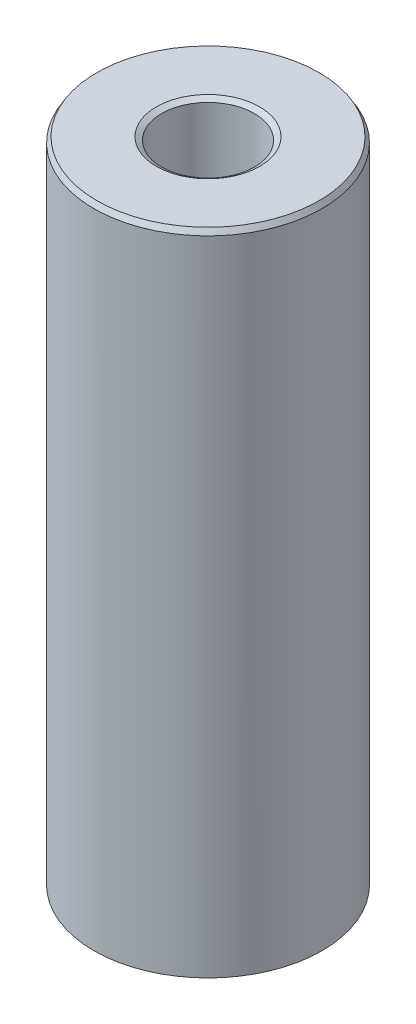
ISO-10303-21;
HEADER;
FILE_DESCRIPTION(('STEP AP214'),'2;1');
FILE_NAME('part.step','',(''),(''),'','','');
FILE_SCHEMA(('AUTOMOTIVE_DESIGN { 1 0 10303 214 1 1 1 1 }'));
ENDSEC;
DATA;
#1=APPLICATION_CONTEXT('core data for automotive mechanical design processes');
#2=APPLICATION_PROTOCOL_DEFINITION('international standard','automotive_design',2000,#1);
#3=PRODUCT_CONTEXT('',#1,'mechanical');
#4=PRODUCT('Part','Part','',(#3));
#5=PRODUCT_RELATED_PRODUCT_CATEGORY('part','',(#4));
#6=PRODUCT_DEFINITION_FORMATION('','',#4);
#7=PRODUCT_DEFINITION_CONTEXT('part definition',#1,'design');
#8=PRODUCT_DEFINITION('design','',#6,#7);
#9=PRODUCT_DEFINITION_SHAPE('','',#8);
#10=(LENGTH_UNIT() NAMED_UNIT(*) SI_UNIT(.MILLI.,.METRE.));
#11=(NAMED_UNIT(*) PLANE_ANGLE_UNIT() SI_UNIT($,.RADIAN.));
#12=(NAMED_UNIT(*) SI_UNIT($,.STERADIAN.) SOLID_ANGLE_UNIT());
#13=UNCERTAINTY_MEASURE_WITH_UNIT(LENGTH_MEASURE(1.E-05),#10,'distance_accuracy_value','');
#14=(GEOMETRIC_REPRESENTATION_CONTEXT(3) GLOBAL_UNCERTAINTY_ASSIGNED_CONTEXT((#13)) GLOBAL_UNIT_ASSIGNED_CONTEXT((#10,
#11,#12)) REPRESENTATION_CONTEXT('',''));
#15=CARTESIAN_POINT('',(0.,0.,0.));
#16=DIRECTION('',(0.,0.,1.));
#17=DIRECTION('',(1.,0.,0.));
#18=AXIS2_PLACEMENT_3D('',#15,#16,#17);
#19=CARTESIAN_POINT('',(0.,299.376387131295,0.));
#20=DIRECTION('',(0.,-1.,0.));
#21=DIRECTION('',(0.,0.,-1.));
#22=AXIS2_PLACEMENT_3D('',#19,#20,#21);
#23=CYLINDRICAL_SURFACE('',#22,52.5);
#24=CARTESIAN_POINT('',(0.,1.44388979616034,0.));
#25=DIRECTION('',(0.,1.,0.));
#26=DIRECTION('',(0.,0.,1.));
#27=AXIS2_PLACEMENT_3D('',#24,#25,#26);
#28=CIRCLE('',#27,52.5);
#29=CARTESIAN_POINT('',(0.,1.44388979616034,52.5));
#30=VERTEX_POINT('',#29);
#31=EDGE_CURVE('E10',#30,#30,#28,.T.);
#32=ORIENTED_EDGE('',*,*,#31,.T.);
#33=EDGE_LOOP('',(#32));
#34=FACE_BOUND('',#33,.T.);
#35=CARTESIAN_POINT('',(0.,296.964633989069,0.));
#36=DIRECTION('',(0.,1.,0.));
#37=DIRECTION('',(0.,0.,1.));
#38=AXIS2_PLACEMENT_3D('',#35,#36,#37);
#39=CIRCLE('',#38,52.5);
#40=CARTESIAN_POINT('',(0.,296.964633989069,-52.5));
#41=VERTEX_POINT('',#40);
#42=EDGE_CURVE('E50',#41,#41,#39,.F.);
#43=ORIENTED_EDGE('',*,*,#42,.T.);
#44=EDGE_LOOP('',(#43));
#45=FACE_BOUND('',#44,.T.);
#46=ADVANCED_FACE('F39',(#34,#45),#23,.T.);
#47=CARTESIAN_POINT('',(0.,299.376387131295,0.));
#48=DIRECTION('',(0.,1.,0.));
#49=DIRECTION('',(0.,0.,1.));
#50=AXIS2_PLACEMENT_3D('',#47,#48,#49);
#51=PLANE('',#50);
#52=CARTESIAN_POINT('',(0.,299.376387131295,0.));
#53=DIRECTION('',(0.,1.,0.));
#54=DIRECTION('',(0.,0.,1.));
#55=AXIS2_PLACEMENT_3D('',#52,#53,#54);
#56=CIRCLE('',#55,23.7471016343658);
#57=CARTESIAN_POINT('',(0.,299.376387131295,23.7471016343658));
#58=VERTEX_POINT('',#57);
#59=EDGE_CURVE('E58',#58,#58,#56,.F.);
#60=ORIENTED_EDGE('',*,*,#59,.T.);
#61=EDGE_LOOP('',(#60));
#62=FACE_BOUND('',#61,.T.);
#63=CARTESIAN_POINT('',(0.,299.376387131295,0.));
#64=DIRECTION('',(0.,1.,0.));
#65=DIRECTION('',(0.,0.,1.));
#66=AXIS2_PLACEMENT_3D('',#63,#64,#65);
#67=CIRCLE('',#66,51.0561102038397);
#68=CARTESIAN_POINT('',(0.,299.376387131295,-51.0561102038397));
#69=VERTEX_POINT('',#68);
#70=EDGE_CURVE('E61',#69,#69,#67,.T.);
#71=ORIENTED_EDGE('',*,*,#70,.T.);
#72=EDGE_LOOP('',(#71));
#73=FACE_BOUND('',#72,.T.);
#74=ADVANCED_FACE('F88',(#62,#73),#51,.T.);
#75=CARTESIAN_POINT('',(0.,0.,0.));
#76=DIRECTION('',(0.,1.,0.));
#77=DIRECTION('',(0.,0.,1.));
#78=AXIS2_PLACEMENT_3D('',#75,#76,#77);
#79=PLANE('',#78);
#80=CARTESIAN_POINT('',(0.,0.,0.));
#81=DIRECTION('',(0.,1.,0.));
#82=DIRECTION('',(0.,0.,1.));
#83=AXIS2_PLACEMENT_3D('',#80,#81,#82);
#84=CIRCLE('',#83,22.7792382882998);
#85=CARTESIAN_POINT('',(0.,0.,22.7792382882998));
#86=VERTEX_POINT('',#85);
#87=EDGE_CURVE('E51',#86,#86,#84,.T.);
#88=ORIENTED_EDGE('',*,*,#87,.T.);
#89=EDGE_LOOP('',(#88));
#90=FACE_BOUND('',#89,.T.);
#91=CARTESIAN_POINT('',(0.,0.,0.));
#92=DIRECTION('',(0.,1.,0.));
#93=DIRECTION('',(0.,0.,1.));
#94=AXIS2_PLACEMENT_3D('',#91,#92,#93);
#95=CIRCLE('',#94,50.0882468577736);
#96=CARTESIAN_POINT('',(0.,0.,50.0882468577736));
#97=VERTEX_POINT('',#96);
#98=EDGE_CURVE('E54',#97,#97,#95,.F.);
#99=ORIENTED_EDGE('',*,*,#98,.T.);
#100=EDGE_LOOP('',(#99));
#101=FACE_BOUND('',#100,.T.);
#102=ADVANCED_FACE('F83',(#90,#101),#79,.F.);
#103=CARTESIAN_POINT('',(0.,299.376387131295,0.));
#104=DIRECTION('',(0.,-1.,0.));
#105=DIRECTION('',(0.,0.,-1.));
#106=AXIS2_PLACEMENT_3D('',#103,#104,#105);
#107=CYLINDRICAL_SURFACE('',#106,21.3353484921394);
#108=CARTESIAN_POINT('',(0.,297.932497335135,0.));
#109=DIRECTION('',(0.,1.,0.));
#110=DIRECTION('',(0.,0.,1.));
#111=AXIS2_PLACEMENT_3D('',#108,#109,#110);
#112=CIRCLE('',#111,21.3353484921394);
#113=CARTESIAN_POINT('',(0.,297.932497335135,21.3353484921394));
#114=VERTEX_POINT('',#113);
#115=EDGE_CURVE('E67',#114,#114,#112,.T.);
#116=ORIENTED_EDGE('',*,*,#115,.T.);
#117=EDGE_LOOP('',(#116));
#118=FACE_BOUND('',#117,.T.);
#119=CARTESIAN_POINT('',(0.,2.41175314222636,0.));
#120=DIRECTION('',(0.,1.,0.));
#121=DIRECTION('',(0.,0.,1.));
#122=AXIS2_PLACEMENT_3D('',#119,#120,#121);
#123=CIRCLE('',#122,21.3353484921394);
#124=CARTESIAN_POINT('',(0.,2.41175314222636,21.3353484921394));
#125=VERTEX_POINT('',#124);
#126=EDGE_CURVE('E69',#125,#125,#123,.F.);
#127=ORIENTED_EDGE('',*,*,#126,.T.);
#128=EDGE_LOOP('',(#127));
#129=FACE_BOUND('',#128,.T.);
#130=ADVANCED_FACE('F71',(#118,#129),#107,.F.);
#131=CARTESIAN_POINT('',(0.,297.932497335135,0.));
#132=DIRECTION('',(0.,1.,0.));
#133=DIRECTION('',(0.,0.,1.));
#134=AXIS2_PLACEMENT_3D('',#131,#132,#133);
#135=CONICAL_SURFACE('',#134,21.3353484921394,1.03134144039072);
#136=ORIENTED_EDGE('',*,*,#59,.F.);
#137=EDGE_LOOP('',(#136));
#138=FACE_BOUND('',#137,.T.);
#139=ORIENTED_EDGE('',*,*,#115,.F.);
#140=EDGE_LOOP('',(#139));
#141=FACE_BOUND('',#140,.T.);
#142=ADVANCED_FACE('F77',(#138,#141),#135,.F.);
#143=CARTESIAN_POINT('',(0.,0.,0.));
#144=DIRECTION('',(0.,-1.,0.));
#145=DIRECTION('',(0.,0.,-1.));
#146=AXIS2_PLACEMENT_3D('',#143,#144,#145);
#147=CONICAL_SURFACE('',#146,22.7792382882998,0.539454886404164);
#148=ORIENTED_EDGE('',*,*,#126,.F.);
#149=EDGE_LOOP('',(#148));
#150=FACE_BOUND('',#149,.T.);
#151=ORIENTED_EDGE('',*,*,#87,.F.);
#152=EDGE_LOOP('',(#151));
#153=FACE_BOUND('',#152,.T.);
#154=ADVANCED_FACE('F73',(#150,#153),#147,.F.);
#155=CARTESIAN_POINT('',(0.,1.44388979616034,0.));
#156=DIRECTION('',(0.,1.,0.));
#157=DIRECTION('',(0.,0.,1.));
#158=AXIS2_PLACEMENT_3D('',#155,#156,#157);
#159=CONICAL_SURFACE('',#158,52.5,1.03134144039073);
#160=ORIENTED_EDGE('',*,*,#98,.F.);
#161=EDGE_LOOP('',(#160));
#162=FACE_BOUND('',#161,.T.);
#163=ORIENTED_EDGE('',*,*,#31,.F.);
#164=EDGE_LOOP('',(#163));
#165=FACE_BOUND('',#164,.T.);
#166=ADVANCED_FACE('F76',(#162,#165),#159,.T.);
#167=CARTESIAN_POINT('',(0.,299.376387131295,0.));
#168=DIRECTION('',(0.,-1.,0.));
#169=DIRECTION('',(0.,0.,-1.));
#170=AXIS2_PLACEMENT_3D('',#167,#168,#169);
#171=CONICAL_SURFACE('',#170,51.0561102038397,0.539454886404153);
#172=CARTESIAN_POINT('',(0.,296.964633989069,-52.5));
#173=CARTESIAN_POINT('',(0.,296.989756417634,-52.48495948129));
#174=CARTESIAN_POINT('',(0.,297.014878846199,-52.46991896258));
#175=CARTESIAN_POINT('',(0.,297.065123703328,-52.43983792516));
#176=CARTESIAN_POINT('',(0.,297.090246131893,-52.42479740645));
#177=CARTESIAN_POINT('',(0.,297.140490989023,-52.39471636903));
#178=CARTESIAN_POINT('',(0.,297.165613417588,-52.37967585032));
#179=CARTESIAN_POINT('',(0.,297.215858274717,-52.3495948129));
#180=CARTESIAN_POINT('',(0.,297.240980703282,-52.33455429419));
#181=CARTESIAN_POINT('',(0.,297.291225560412,-52.30447325677));
#182=CARTESIAN_POINT('',(0.,297.316347988977,-52.28943273806));
#183=CARTESIAN_POINT('',(0.,297.366592846107,-52.25935170064));
#184=CARTESIAN_POINT('',(0.,297.391715274672,-52.24431118193));
#185=CARTESIAN_POINT('',(0.,297.441960131801,-52.2142301445099));
#186=CARTESIAN_POINT('',(0.,297.467082560366,-52.1991896257999));
#187=CARTESIAN_POINT('',(0.,297.517327417496,-52.1691085883799));
#188=CARTESIAN_POINT('',(0.,297.542449846061,-52.1540680696699));
#189=CARTESIAN_POINT('',(0.,297.59269470319,-52.1239870322499));
#190=CARTESIAN_POINT('',(0.,297.617817131755,-52.1089465135399));
#191=CARTESIAN_POINT('',(0.,297.668061988885,-52.0788654761199));
#192=CARTESIAN_POINT('',(0.,297.69318441745,-52.0638249574099));
#193=CARTESIAN_POINT('',(0.,297.74342927458,-52.0337439199899));
#194=CARTESIAN_POINT('',(0.,297.768551703144,-52.0187034012799));
#195=CARTESIAN_POINT('',(0.,297.818796560274,-51.9886223638599));
#196=CARTESIAN_POINT('',(0.,297.843918988839,-51.9735818451499));
#197=CARTESIAN_POINT('',(0.,297.894163845969,-51.9435008077299));
#198=CARTESIAN_POINT('',(0.,297.919286274534,-51.9284602890199));
#199=CARTESIAN_POINT('',(0.,297.969531131663,-51.8983792515999));
#200=CARTESIAN_POINT('',(0.,297.994653560228,-51.8833387328899));
#201=CARTESIAN_POINT('',(0.,298.044898417358,-51.8532576954699));
#202=CARTESIAN_POINT('',(0.,298.070020845923,-51.8382171767599));
#203=CARTESIAN_POINT('',(0.,298.120265703052,-51.8081361393399));
#204=CARTESIAN_POINT('',(0.,298.145388131617,-51.7930956206298));
#205=CARTESIAN_POINT('',(0.,298.195632988747,-51.7630145832098));
#206=CARTESIAN_POINT('',(0.,298.220755417312,-51.7479740644998));
#207=CARTESIAN_POINT('',(0.,298.271000274442,-51.7178930270798));
#208=CARTESIAN_POINT('',(0.,298.296122703006,-51.7028525083698));
#209=CARTESIAN_POINT('',(0.,298.346367560136,-51.6727714709498));
#210=CARTESIAN_POINT('',(0.,298.371489988701,-51.6577309522398));
#211=CARTESIAN_POINT('',(0.,298.421734845831,-51.6276499148198));
#212=CARTESIAN_POINT('',(0.,298.446857274396,-51.6126093961098));
#213=CARTESIAN_POINT('',(0.,298.497102131525,-51.5825283586898));
#214=CARTESIAN_POINT('',(0.,298.52222456009,-51.5674878399798));
#215=CARTESIAN_POINT('',(0.,298.57246941722,-51.5374068025598));
#216=CARTESIAN_POINT('',(0.,298.597591845785,-51.5223662838498));
#217=CARTESIAN_POINT('',(0.,298.647836702914,-51.4922852464298));
#218=CARTESIAN_POINT('',(0.,298.672959131479,-51.4772447277198));
#219=CARTESIAN_POINT('',(0.,298.723203988609,-51.4471636902998));
#220=CARTESIAN_POINT('',(0.,298.748326417174,-51.4321231715898));
#221=CARTESIAN_POINT('',(0.,298.798571274304,-51.4020421341698));
#222=CARTESIAN_POINT('',(0.,298.823693702868,-51.3870016154598));
#223=CARTESIAN_POINT('',(0.,298.873938559998,-51.3569205780397));
#224=CARTESIAN_POINT('',(0.,298.899060988563,-51.3418800593297));
#225=CARTESIAN_POINT('',(0.,298.949305845693,-51.3117990219097));
#226=CARTESIAN_POINT('',(0.,298.974428274258,-51.2967585031997));
#227=CARTESIAN_POINT('',(0.,299.024673131387,-51.2666774657797));
#228=CARTESIAN_POINT('',(0.,299.049795559952,-51.2516369470697));
#229=CARTESIAN_POINT('',(0.,299.100040417082,-51.2215559096497));
#230=CARTESIAN_POINT('',(0.,299.125162845647,-51.2065153909397));
#231=CARTESIAN_POINT('',(0.,299.175407702776,-51.1764343535197));
#232=CARTESIAN_POINT('',(0.,299.200530131341,-51.1613938348097));
#233=CARTESIAN_POINT('',(0.,299.250774988471,-51.1313127973897));
#234=CARTESIAN_POINT('',(0.,299.275897417036,-51.1162722786797));
#235=CARTESIAN_POINT('',(0.,299.326142274166,-51.0861912412597));
#236=CARTESIAN_POINT('',(0.,299.35126470273,-51.0711507225497));
#237=CARTESIAN_POINT('',(0.,299.376387131295,-51.0561102038397));
#238=B_SPLINE_CURVE_WITH_KNOTS('',3,(#172,#173,#174,#175,#176,#177,#178,#179,#180,#181,#182,
#183,#184,#185,#186,#187,#188,#189,#190,#191,#192,#193,#194,#195,#196,#197,#198,#199,#200,#201,
#202,#203,#204,#205,#206,#207,#208,#209,#210,#211,#212,#213,#214,#215,#216,#217,#218,#219,#220,
#221,#222,#223,#224,#225,#226,#227,#228,#229,#230,#231,#232,#233,#234,#235,#236,#237),
.UNSPECIFIED.,.F.,.F.,(4,2,2,2,2,2,2,2,2,2,2,2,2,2,2,2,2,2,2,2,2,2,2,2,2,2,2,2,2,2,2,2,4),(0.,
0.0878418042879895,0.175683608575931,0.263525412863873,0.351367217151815,0.439209021439753,
0.527050825727695,0.614892630015637,0.702734434303579,0.790576238591521,0.878418042879459,
0.966259847167448,1.05410165145539,1.14194345574333,1.22978526003127,1.31762706431921,
1.40546886860715,1.4933106728951,1.58115247718304,1.66899428147098,1.75683608575892,
1.84467789004686,1.93251969433485,2.02036149862279,2.10820330291073,2.19604510719867,
2.28388691148661,2.37172871577455,2.45957052006249,2.54741232435043,2.63525412863838,
2.72309593292632,2.81093773721431),.UNSPECIFIED.);
#239=EDGE_CURVE('BSEAM45',#41,#69,#238,.T.);
#240=ORIENTED_EDGE('',*,*,#42,.F.);
#241=ORIENTED_EDGE('',*,*,#70,.F.);
#242=ORIENTED_EDGE('',*,*,#239,.T.);
#243=ORIENTED_EDGE('',*,*,#239,.F.);
#244=EDGE_LOOP('',(#240,#242,#241,#243));
#245=FACE_BOUND('',#244,.T.);
#246=ADVANCED_FACE('F45',(#245),#171,.T.);
#247=CLOSED_SHELL('',(#46,#74,#102,#130,#142,#154,#166,#246));
#248=MANIFOLD_SOLID_BREP('B2',#247);
#249=ADVANCED_BREP_SHAPE_REPRESENTATION('',(#18,#248),#14);
#250=SHAPE_DEFINITION_REPRESENTATION(#9,#249);
ENDSEC;
END-ISO-10303-21;
